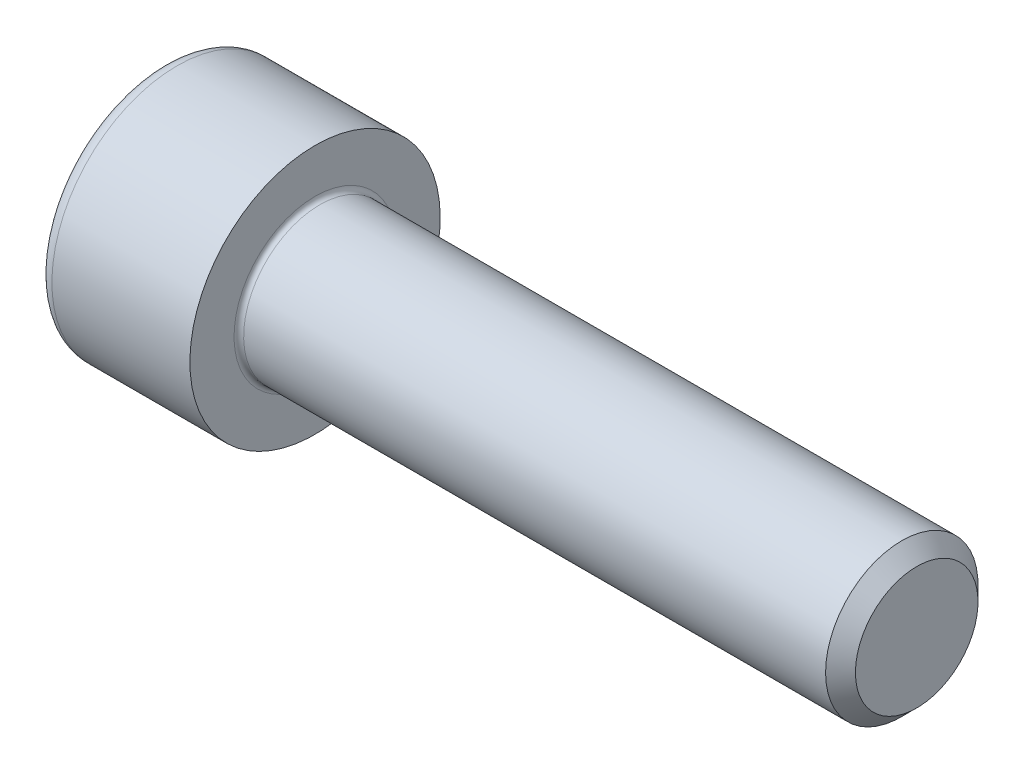
ISO-10303-21;
HEADER;
FILE_DESCRIPTION(('STEP AP214'),'2;1');
FILE_NAME('part.step','',(''),(''),'','','');
FILE_SCHEMA(('AUTOMOTIVE_DESIGN { 1 0 10303 214 1 1 1 1 }'));
ENDSEC;
DATA;
#1=APPLICATION_CONTEXT('core data for automotive mechanical design processes');
#2=APPLICATION_PROTOCOL_DEFINITION('international standard','automotive_design',2000,#1);
#3=PRODUCT_CONTEXT('',#1,'mechanical');
#4=PRODUCT('Part','Part','',(#3));
#5=PRODUCT_RELATED_PRODUCT_CATEGORY('part','',(#4));
#6=PRODUCT_DEFINITION_FORMATION('','',#4);
#7=PRODUCT_DEFINITION_CONTEXT('part definition',#1,'design');
#8=PRODUCT_DEFINITION('design','',#6,#7);
#9=PRODUCT_DEFINITION_SHAPE('','',#8);
#10=(LENGTH_UNIT() NAMED_UNIT(*) SI_UNIT(.MILLI.,.METRE.));
#11=(NAMED_UNIT(*) PLANE_ANGLE_UNIT() SI_UNIT($,.RADIAN.));
#12=(NAMED_UNIT(*) SI_UNIT($,.STERADIAN.) SOLID_ANGLE_UNIT());
#13=UNCERTAINTY_MEASURE_WITH_UNIT(LENGTH_MEASURE(1.E-05),#10,'distance_accuracy_value','');
#14=(GEOMETRIC_REPRESENTATION_CONTEXT(3) GLOBAL_UNCERTAINTY_ASSIGNED_CONTEXT((#13)) GLOBAL_UNIT_ASSIGNED_CONTEXT((#10,
#11,#12)) REPRESENTATION_CONTEXT('',''));
#15=CARTESIAN_POINT('',(0.,0.,0.));
#16=DIRECTION('',(0.,0.,1.));
#17=DIRECTION('',(1.,0.,0.));
#18=AXIS2_PLACEMENT_3D('',#15,#16,#17);
#19=CARTESIAN_POINT('',(-2.54792480126298,0.,0.));
#20=DIRECTION('',(-1.,0.,0.));
#21=DIRECTION('',(0.,0.,1.));
#22=AXIS2_PLACEMENT_3D('',#19,#20,#21);
#23=CONICAL_SURFACE('',#22,2.30141886197543,1.04719754991776);
#24=CARTESIAN_POINT('',(-1.21919999804732,-1.13686837721616E-10,0.));
#25=VERTEX_POINT('',#24);
#26=VERTEX_LOOP('',#25);
#27=FACE_BOUND('',#26,.T.);
#28=CARTESIAN_POINT('',(-2.54000000142803,1.98120000032526,1.14384635290626));
#29=CARTESIAN_POINT('',(-2.51097100848054,1.98120000011682,1.04331611318357));
#30=CARTESIAN_POINT('',(-2.48457065859602,1.98120000003131,0.941918097876422));
#31=CARTESIAN_POINT('',(-2.4384896407386,1.98119999996862,0.73736642845936));
#32=CARTESIAN_POINT('',(-2.41882527270383,1.98119999999169,0.634209141045213));
#33=CARTESIAN_POINT('',(-2.38821626617254,1.9812000000081,0.429172942767851));
#34=CARTESIAN_POINT('',(-2.37706788401862,1.98120000000216,0.327325570515035));
#35=CARTESIAN_POINT('',(-2.36376153116973,1.98119999999784,0.123151850494912));
#36=CARTESIAN_POINT('',(-2.36159253902039,1.98119999999946,0.0208262443343671));
#37=CARTESIAN_POINT('',(-2.36611630830126,1.98120000000047,-0.170358173456619));
#38=CARTESIAN_POINT('',(-2.37169833443295,1.98120000000013,-0.259245673867026));
#39=CARTESIAN_POINT('',(-2.38938650344235,1.98119999999987,-0.436441601614261));
#40=CARTESIAN_POINT('',(-2.40149868265029,1.98119999999996,-0.524749416535121));
#41=CARTESIAN_POINT('',(-2.43177678635069,1.98120000000004,-0.702310384603506));
#42=CARTESIAN_POINT('',(-2.45007099786355,1.98120000000002,-0.791541076350807));
#43=CARTESIAN_POINT('',(-2.49159112384591,1.98119999999998,-0.968671968992441));
#44=CARTESIAN_POINT('',(-2.5148072890003,1.98119999999996,-1.05657443738776));
#45=CARTESIAN_POINT('',(-2.54000000163953,1.9812,-1.14384635290124));
#46=B_SPLINE_CURVE_WITH_KNOTS('',3,(#28,#29,#30,#31,#32,#33,#34,#35,#36,#37,#38,#39,#40,#41,#42,
#43,#44,#45),.UNSPECIFIED.,.F.,.F.,(4,2,2,2,2,2,2,2,4),(0.,0.314036061113456,0.628826755288795,
0.935827354837613,1.24245102476025,1.50938492945134,1.77656600610952,2.04967187875051,
2.32224175984928),.UNSPECIFIED.);
#47=CARTESIAN_POINT('',(-2.54000000162459,1.98119999979693,1.14384635320125));
#48=VERTEX_POINT('',#47);
#49=CARTESIAN_POINT('',(-2.54000000169229,1.9812,-1.143846353084));
#50=VERTEX_POINT('',#49);
#51=EDGE_CURVE('E19',#48,#50,#46,.T.);
#52=ORIENTED_EDGE('',*,*,#51,.T.);
#53=CARTESIAN_POINT('',(-2.54000000142803,1.98119999980562,-1.14384635380629));
#54=CARTESIAN_POINT('',(-2.51097100848054,1.89413825825301,-1.19411147348712));
#55=CARTESIAN_POINT('',(-2.48457065859602,1.80632500106095,-1.24481048106664));
#56=CARTESIAN_POINT('',(-2.4384896407386,1.62917805892791,-1.34708631572088));
#57=CARTESIAN_POINT('',(-2.41882527270383,1.5398412274533,-1.39866495944794));
#58=CARTESIAN_POINT('',(-2.38821626617254,1.36227467105793,-1.50118305860083));
#59=CARTESIAN_POINT('',(-2.37706788401862,1.27407225937533,-1.55210674472209));
#60=CARTESIAN_POINT('',(-2.36376153116974,1.09725263105057,-1.65419360472841));
#61=CARTESIAN_POINT('',(-2.36159253902039,1.00863605665871,-1.70535640781009));
#62=CARTESIAN_POINT('',(-2.36611630830126,0.843065494044483,-1.80094861670645));
#63=CARTESIAN_POINT('',(-2.37169833443295,0.76608666061,-1.84539236691136));
#64=CARTESIAN_POINT('',(-2.38938650344236,0.612630485733617,-1.93399033078476));
#65=CARTESIAN_POINT('',(-2.40149868265029,0.536153674659503,-1.97814423824526));
#66=CARTESIAN_POINT('',(-2.43177678635069,0.382381365591762,-2.06692472227952));
#67=CARTESIAN_POINT('',(-2.45007099786355,0.305105319741333,-2.11154006815315));
#68=CARTESIAN_POINT('',(-2.49159112384592,0.151705466918646,-2.20010551447394));
#69=CARTESIAN_POINT('',(-2.5148072890003,0.0755796962329284,-2.24405674867158));
#70=CARTESIAN_POINT('',(-2.54000000163953,3.61344997547962E-10,-2.28769270642835));
#71=B_SPLINE_CURVE_WITH_KNOTS('',3,(#53,#54,#55,#56,#57,#58,#59,#60,#61,#62,#63,#64,#65,#66,#67,
#68,#69,#70),.UNSPECIFIED.,.F.,.F.,(4,2,2,2,2,2,2,2,4),(0.,0.314036061113456,0.628826755288795,
0.935827354837614,1.24245102476025,1.50938492945134,1.77656600610951,2.04967187875051,
2.32224175984927),.UNSPECIFIED.);
#72=CARTESIAN_POINT('',(-2.5400000016246,0.,-2.28769270640249));
#73=VERTEX_POINT('',#72);
#74=EDGE_CURVE('E79',#50,#73,#71,.T.);
#75=ORIENTED_EDGE('',*,*,#74,.T.);
#76=CARTESIAN_POINT('',(-2.54000000142803,-5.19638780479106E-10,-2.28769270671254));
#77=CARTESIAN_POINT('',(-2.51097100848054,-0.0870617418638079,-2.23742758667069));
#78=CARTESIAN_POINT('',(-2.48457065859602,-0.174874998970364,-2.18672857894306));
#79=CARTESIAN_POINT('',(-2.4384896407386,-0.35202194104071,-2.08445274418024));
#80=CARTESIAN_POINT('',(-2.41882527270384,-0.441358772538393,-2.03287410049315));
#81=CARTESIAN_POINT('',(-2.38821626617254,-0.618925328950177,-1.93035600136868));
#82=CARTESIAN_POINT('',(-2.37706788401862,-0.707127740626835,-1.87943231523712));
#83=CARTESIAN_POINT('',(-2.36376153116974,-0.883947368947275,-1.77734545522332));
#84=CARTESIAN_POINT('',(-2.36159253902039,-0.972563943340757,-1.72618265214445));
#85=CARTESIAN_POINT('',(-2.36611630830126,-1.13813450595599,-1.63059044324983));
#86=CARTESIAN_POINT('',(-2.37169833443295,-1.21511333939013,-1.58614669304433));
#87=CARTESIAN_POINT('',(-2.38938650344236,-1.36856951426626,-1.4975487291705));
#88=CARTESIAN_POINT('',(-2.40149868265029,-1.44504632534046,-1.45339482171014));
#89=CARTESIAN_POINT('',(-2.4317767863507,-1.59881863440828,-1.36461433767602));
#90=CARTESIAN_POINT('',(-2.45007099786355,-1.67609468025869,-1.31999899180235));
#91=CARTESIAN_POINT('',(-2.49159112384592,-1.82949453308134,-1.2314335454815));
#92=CARTESIAN_POINT('',(-2.5148072890003,-1.90562030376703,-1.18748231128383));
#93=CARTESIAN_POINT('',(-2.54000000163953,-1.98119999963865,-1.14384635352712));
#94=B_SPLINE_CURVE_WITH_KNOTS('',3,(#76,#77,#78,#79,#80,#81,#82,#83,#84,#85,#86,#87,#88,#89,#90,
#91,#92,#93),.UNSPECIFIED.,.F.,.F.,(4,2,2,2,2,2,2,2,4),(0.,0.314036061113457,0.628826755288796,
0.935827354837616,1.24245102476025,1.50938492945134,1.77656600610951,2.0496718787505,
2.32224175984926),.UNSPECIFIED.);
#95=CARTESIAN_POINT('',(-2.5400000016246,-1.98119999979693,-1.14384635320125));
#96=VERTEX_POINT('',#95);
#97=EDGE_CURVE('E104',#73,#96,#94,.T.);
#98=ORIENTED_EDGE('',*,*,#97,.T.);
#99=CARTESIAN_POINT('',(-2.54000000142803,-1.98120000032526,-1.14384635290626));
#100=CARTESIAN_POINT('',(-2.51097100848054,-1.98120000011682,-1.04331611318357));
#101=CARTESIAN_POINT('',(-2.48457065859602,-1.98120000003131,-0.941918097876424));
#102=CARTESIAN_POINT('',(-2.4384896407386,-1.98119999996862,-0.737366428459362));
#103=CARTESIAN_POINT('',(-2.41882527270383,-1.98119999999169,-0.634209141045214));
#104=CARTESIAN_POINT('',(-2.38821626617254,-1.9812000000081,-0.429172942767853));
#105=CARTESIAN_POINT('',(-2.37706788401862,-1.98120000000216,-0.327325570515037));
#106=CARTESIAN_POINT('',(-2.36376153116973,-1.98119999999784,-0.123151850494914));
#107=CARTESIAN_POINT('',(-2.36159253902039,-1.98119999999946,-0.020826244334369));
#108=CARTESIAN_POINT('',(-2.36611630830126,-1.98120000000047,0.170358173456617));
#109=CARTESIAN_POINT('',(-2.37169833443295,-1.98120000000013,0.259245673867024));
#110=CARTESIAN_POINT('',(-2.38938650344235,-1.98119999999987,0.436441601614259));
#111=CARTESIAN_POINT('',(-2.40149868265029,-1.98119999999996,0.52474941653512));
#112=CARTESIAN_POINT('',(-2.43177678635069,-1.98120000000004,0.702310384603505));
#113=CARTESIAN_POINT('',(-2.45007099786355,-1.98120000000002,0.791541076350806));
#114=CARTESIAN_POINT('',(-2.49159112384591,-1.98119999999998,0.96867196899244));
#115=CARTESIAN_POINT('',(-2.5148072890003,-1.98119999999996,1.05657443738776));
#116=CARTESIAN_POINT('',(-2.54000000163953,-1.9812,1.14384635290124));
#117=B_SPLINE_CURVE_WITH_KNOTS('',3,(#99,#100,#101,#102,#103,#104,#105,#106,#107,#108,#109,#110,
#111,#112,#113,#114,#115,#116),.UNSPECIFIED.,.F.,.F.,(4,2,2,2,2,2,2,2,4),(0.,0.314036061113456,
0.628826755288795,0.935827354837614,1.24245102476025,1.50938492945134,1.77656600610952,
2.04967187875052,2.32224175984928),.UNSPECIFIED.);
#118=CARTESIAN_POINT('',(-2.54000000162459,-1.98119999979693,1.14384635320125));
#119=VERTEX_POINT('',#118);
#120=EDGE_CURVE('E128',#96,#119,#117,.T.);
#121=ORIENTED_EDGE('',*,*,#120,.T.);
#122=CARTESIAN_POINT('',(-2.54000000142803,-1.98119999980562,1.14384635380629));
#123=CARTESIAN_POINT('',(-2.51097100848054,-1.89413825825301,1.19411147348712));
#124=CARTESIAN_POINT('',(-2.48457065859602,-1.80632500106095,1.24481048106664));
#125=CARTESIAN_POINT('',(-2.4384896407386,-1.62917805892791,1.34708631572088));
#126=CARTESIAN_POINT('',(-2.41882527270383,-1.5398412274533,1.39866495944794));
#127=CARTESIAN_POINT('',(-2.38821626617254,-1.36227467105793,1.50118305860083));
#128=CARTESIAN_POINT('',(-2.37706788401862,-1.27407225937533,1.55210674472209));
#129=CARTESIAN_POINT('',(-2.36376153116974,-1.09725263105057,1.65419360472841));
#130=CARTESIAN_POINT('',(-2.36159253902039,-1.00863605665871,1.70535640781009));
#131=CARTESIAN_POINT('',(-2.36611630830126,-0.843065494044483,1.80094861670645));
#132=CARTESIAN_POINT('',(-2.37169833443295,-0.76608666061,1.84539236691136));
#133=CARTESIAN_POINT('',(-2.38938650344236,-0.612630485733617,1.93399033078476));
#134=CARTESIAN_POINT('',(-2.40149868265029,-0.536153674659503,1.97814423824526));
#135=CARTESIAN_POINT('',(-2.43177678635069,-0.382381365591762,2.06692472227952));
#136=CARTESIAN_POINT('',(-2.45007099786355,-0.305105319741333,2.11154006815315));
#137=CARTESIAN_POINT('',(-2.49159112384591,-0.151705466918646,2.20010551447394));
#138=CARTESIAN_POINT('',(-2.5148072890003,-0.0755796962329291,2.24405674867158));
#139=CARTESIAN_POINT('',(-2.54000000163953,-3.61345646756782E-10,2.28769270642835));
#140=B_SPLINE_CURVE_WITH_KNOTS('',3,(#122,#123,#124,#125,#126,#127,#128,#129,#130,#131,#132,
#133,#134,#135,#136,#137,#138,#139),.UNSPECIFIED.,.F.,.F.,(4,2,2,2,2,2,2,2,4),(0.,
0.314036061113456,0.628826755288795,0.935827354837614,1.24245102476025,1.50938492945134,
1.77656600610951,2.04967187875051,2.32224175984927),.UNSPECIFIED.);
#141=CARTESIAN_POINT('',(-2.5400000016246,0.,2.28769270640249));
#142=VERTEX_POINT('',#141);
#143=EDGE_CURVE('E136',#119,#142,#140,.T.);
#144=ORIENTED_EDGE('',*,*,#143,.T.);
#145=CARTESIAN_POINT('',(-2.54000000142803,5.19638028011952E-10,2.28769270671254));
#146=CARTESIAN_POINT('',(-2.51097100848054,0.0870617418638069,2.23742758667069));
#147=CARTESIAN_POINT('',(-2.48457065859602,0.174874998970363,2.18672857894306));
#148=CARTESIAN_POINT('',(-2.4384896407386,0.352021941040709,2.08445274418023));
#149=CARTESIAN_POINT('',(-2.41882527270384,0.441358772538392,2.03287410049314));
#150=CARTESIAN_POINT('',(-2.38821626617254,0.618925328950176,1.93035600136868));
#151=CARTESIAN_POINT('',(-2.37706788401862,0.707127740626834,1.87943231523712));
#152=CARTESIAN_POINT('',(-2.36376153116974,0.883947368947274,1.77734545522332));
#153=CARTESIAN_POINT('',(-2.36159253902039,0.972563943340755,1.72618265214445));
#154=CARTESIAN_POINT('',(-2.36611630830126,1.13813450595599,1.63059044324983));
#155=CARTESIAN_POINT('',(-2.37169833443295,1.21511333939013,1.58614669304433));
#156=CARTESIAN_POINT('',(-2.38938650344236,1.36856951426626,1.49754872917049));
#157=CARTESIAN_POINT('',(-2.40149868265029,1.44504632534046,1.45339482171014));
#158=CARTESIAN_POINT('',(-2.43177678635069,1.59881863440828,1.36461433767602));
#159=CARTESIAN_POINT('',(-2.45007099786355,1.67609468025869,1.31999899180235));
#160=CARTESIAN_POINT('',(-2.49159112384592,1.82949453308134,1.2314335454815));
#161=CARTESIAN_POINT('',(-2.5148072890003,1.90562030376703,1.18748231128382));
#162=CARTESIAN_POINT('',(-2.54000000163953,1.98119999963865,1.14384635352712));
#163=B_SPLINE_CURVE_WITH_KNOTS('',3,(#145,#146,#147,#148,#149,#150,#151,#152,#153,#154,#155,
#156,#157,#158,#159,#160,#161,#162),.UNSPECIFIED.,.F.,.F.,(4,2,2,2,2,2,2,2,4),(0.,
0.314036061113457,0.628826755288796,0.935827354837616,1.24245102476025,1.50938492945134,
1.77656600610951,2.04967187875051,2.32224175984927),.UNSPECIFIED.);
#164=EDGE_CURVE('E81',#142,#48,#163,.T.);
#165=ORIENTED_EDGE('',*,*,#164,.T.);
#166=EDGE_LOOP('',(#52,#75,#98,#121,#144,#165));
#167=FACE_BOUND('',#166,.T.);
#168=ADVANCED_FACE('F15',(#27,#167),#23,.F.);
#169=CARTESIAN_POINT('',(-4.826,1.9812,1.14384635331849));
#170=DIRECTION('',(0.,1.,0.));
#171=DIRECTION('',(0.,0.,1.));
#172=AXIS2_PLACEMENT_3D('',#169,#170,#171);
#173=PLANE('',#172);
#174=DIRECTION('',(1.,0.,0.));
#175=VECTOR('',#174,1.);
#176=CARTESIAN_POINT('',(-4.826,1.9812,1.14384635331849));
#177=LINE('',#176,#175);
#178=CARTESIAN_POINT('',(-4.826,1.9812,1.14384635331849));
#179=VERTEX_POINT('',#178);
#180=EDGE_CURVE('E83',#48,#179,#177,.F.);
#181=ORIENTED_EDGE('',*,*,#180,.T.);
#182=DIRECTION('',(0.,0.,1.));
#183=VECTOR('',#182,1.);
#184=CARTESIAN_POINT('',(-4.826,1.9812,0.));
#185=LINE('',#184,#183);
#186=CARTESIAN_POINT('',(-4.826,1.9812,-1.14384635331849));
#187=VERTEX_POINT('',#186);
#188=EDGE_CURVE('E88',#187,#179,#185,.T.);
#189=ORIENTED_EDGE('',*,*,#188,.F.);
#190=DIRECTION('',(1.,0.,0.));
#191=VECTOR('',#190,1.);
#192=CARTESIAN_POINT('',(-4.826,1.9812,-1.14384635331849));
#193=LINE('',#192,#191);
#194=EDGE_CURVE('E86',#187,#50,#193,.T.);
#195=ORIENTED_EDGE('',*,*,#194,.T.);
#196=ORIENTED_EDGE('',*,*,#51,.F.);
#197=EDGE_LOOP('',(#181,#189,#195,#196));
#198=FACE_BOUND('',#197,.T.);
#199=ADVANCED_FACE('F75',(#198),#173,.F.);
#200=CARTESIAN_POINT('',(-4.826,0.,2.28769270663698));
#201=DIRECTION('',(0.,0.500000000000001,0.866025403784438));
#202=DIRECTION('',(0.,-0.866025403784438,0.500000000000001));
#203=AXIS2_PLACEMENT_3D('',#200,#201,#202);
#204=PLANE('',#203);
#205=DIRECTION('',(1.,0.,0.));
#206=VECTOR('',#205,1.);
#207=CARTESIAN_POINT('',(-4.826,0.,2.28769270663698));
#208=LINE('',#207,#206);
#209=CARTESIAN_POINT('',(-4.826,0.,2.28769270663698));
#210=VERTEX_POINT('',#209);
#211=EDGE_CURVE('E140',#142,#210,#208,.F.);
#212=ORIENTED_EDGE('',*,*,#211,.T.);
#213=DIRECTION('',(0.,-0.866025403784438,0.500000000000002));
#214=VECTOR('',#213,1.);
#215=CARTESIAN_POINT('',(-4.826,1.9812,1.14384635331849));
#216=LINE('',#215,#214);
#217=EDGE_CURVE('E94',#179,#210,#216,.T.);
#218=ORIENTED_EDGE('',*,*,#217,.F.);
#219=ORIENTED_EDGE('',*,*,#180,.F.);
#220=ORIENTED_EDGE('',*,*,#164,.F.);
#221=EDGE_LOOP('',(#212,#218,#219,#220));
#222=FACE_BOUND('',#221,.T.);
#223=ADVANCED_FACE('F144',(#222),#204,.F.);
#224=CARTESIAN_POINT('',(-4.826,-1.9812,1.14384635331849));
#225=DIRECTION('',(0.,-0.5,0.866025403784439));
#226=DIRECTION('',(0.,-0.866025403784439,-0.5));
#227=AXIS2_PLACEMENT_3D('',#224,#225,#226);
#228=PLANE('',#227);
#229=DIRECTION('',(1.,0.,0.));
#230=VECTOR('',#229,1.);
#231=CARTESIAN_POINT('',(-4.826,-1.9812,1.14384635331849));
#232=LINE('',#231,#230);
#233=CARTESIAN_POINT('',(-4.826,-1.9812,1.14384635331849));
#234=VERTEX_POINT('',#233);
#235=EDGE_CURVE('E135',#119,#234,#232,.F.);
#236=ORIENTED_EDGE('',*,*,#235,.T.);
#237=DIRECTION('',(0.,-0.866025403784438,-0.500000000000002));
#238=VECTOR('',#237,1.);
#239=CARTESIAN_POINT('',(-4.826,0.,2.28769270663698));
#240=LINE('',#239,#238);
#241=EDGE_CURVE('E245',#210,#234,#240,.T.);
#242=ORIENTED_EDGE('',*,*,#241,.F.);
#243=ORIENTED_EDGE('',*,*,#211,.F.);
#244=ORIENTED_EDGE('',*,*,#143,.F.);
#245=EDGE_LOOP('',(#236,#242,#243,#244));
#246=FACE_BOUND('',#245,.T.);
#247=ADVANCED_FACE('F124',(#246),#228,.F.);
#248=CARTESIAN_POINT('',(-4.826,-1.9812,-1.14384635331849));
#249=DIRECTION('',(0.,-1.,0.));
#250=DIRECTION('',(0.,0.,-1.));
#251=AXIS2_PLACEMENT_3D('',#248,#249,#250);
#252=PLANE('',#251);
#253=DIRECTION('',(1.,0.,0.));
#254=VECTOR('',#253,1.);
#255=CARTESIAN_POINT('',(-4.826,-1.9812,-1.1438463533185));
#256=LINE('',#255,#254);
#257=CARTESIAN_POINT('',(-4.826,-1.9812,-1.14384635331849));
#258=VERTEX_POINT('',#257);
#259=EDGE_CURVE('E134',#96,#258,#256,.F.);
#260=ORIENTED_EDGE('',*,*,#259,.T.);
#261=DIRECTION('',(0.,0.,1.));
#262=VECTOR('',#261,1.);
#263=CARTESIAN_POINT('',(-4.826,-1.9812,0.));
#264=LINE('',#263,#262);
#265=EDGE_CURVE('E242',#234,#258,#264,.F.);
#266=ORIENTED_EDGE('',*,*,#265,.F.);
#267=ORIENTED_EDGE('',*,*,#235,.F.);
#268=ORIENTED_EDGE('',*,*,#120,.F.);
#269=EDGE_LOOP('',(#260,#266,#267,#268));
#270=FACE_BOUND('',#269,.T.);
#271=ADVANCED_FACE('F120',(#270),#252,.F.);
#272=CARTESIAN_POINT('',(-4.826,0.,-2.28769270663698));
#273=DIRECTION('',(0.,-0.5,-0.866025403784439));
#274=DIRECTION('',(0.,0.866025403784439,-0.5));
#275=AXIS2_PLACEMENT_3D('',#272,#273,#274);
#276=PLANE('',#275);
#277=DIRECTION('',(1.,0.,0.));
#278=VECTOR('',#277,1.);
#279=CARTESIAN_POINT('',(-4.826,0.,-2.28769270663698));
#280=LINE('',#279,#278);
#281=CARTESIAN_POINT('',(-4.826,0.,-2.28769270663698));
#282=VERTEX_POINT('',#281);
#283=EDGE_CURVE('E37',#73,#282,#280,.F.);
#284=ORIENTED_EDGE('',*,*,#283,.T.);
#285=DIRECTION('',(0.,0.866025403784438,-0.500000000000002));
#286=VECTOR('',#285,1.);
#287=CARTESIAN_POINT('',(-4.826,-1.9812,-1.14384635331849));
#288=LINE('',#287,#286);
#289=EDGE_CURVE('E239',#258,#282,#288,.T.);
#290=ORIENTED_EDGE('',*,*,#289,.F.);
#291=ORIENTED_EDGE('',*,*,#259,.F.);
#292=ORIENTED_EDGE('',*,*,#97,.F.);
#293=EDGE_LOOP('',(#284,#290,#291,#292));
#294=FACE_BOUND('',#293,.T.);
#295=ADVANCED_FACE('F114',(#294),#276,.F.);
#296=CARTESIAN_POINT('',(-4.826,1.9812,-1.14384635331849));
#297=DIRECTION('',(0.,0.5,-0.866025403784439));
#298=DIRECTION('',(0.,0.866025403784439,0.5));
#299=AXIS2_PLACEMENT_3D('',#296,#297,#298);
#300=PLANE('',#299);
#301=ORIENTED_EDGE('',*,*,#194,.F.);
#302=DIRECTION('',(0.,0.866025403784438,0.500000000000002));
#303=VECTOR('',#302,1.);
#304=CARTESIAN_POINT('',(-4.826,0.,-2.28769270663698));
#305=LINE('',#304,#303);
#306=EDGE_CURVE('E237',#282,#187,#305,.T.);
#307=ORIENTED_EDGE('',*,*,#306,.F.);
#308=ORIENTED_EDGE('',*,*,#283,.F.);
#309=ORIENTED_EDGE('',*,*,#74,.F.);
#310=EDGE_LOOP('',(#301,#307,#308,#309));
#311=FACE_BOUND('',#310,.T.);
#312=ADVANCED_FACE('F92',(#311),#300,.F.);
#313=CARTESIAN_POINT('',(-4.826,3.12504635331849,0.));
#314=DIRECTION('',(-1.,0.,0.));
#315=DIRECTION('',(0.,0.,1.));
#316=AXIS2_PLACEMENT_3D('',#313,#314,#315);
#317=PLANE('',#316);
#318=ORIENTED_EDGE('',*,*,#289,.T.);
#319=ORIENTED_EDGE('',*,*,#306,.T.);
#320=ORIENTED_EDGE('',*,*,#188,.T.);
#321=ORIENTED_EDGE('',*,*,#217,.T.);
#322=ORIENTED_EDGE('',*,*,#241,.T.);
#323=ORIENTED_EDGE('',*,*,#265,.T.);
#324=EDGE_LOOP('',(#318,#319,#320,#321,#322,#323));
#325=FACE_BOUND('',#324,.T.);
#326=CARTESIAN_POINT('',(-4.826,0.,0.));
#327=DIRECTION('',(1.,0.,0.));
#328=DIRECTION('',(0.,1.,0.));
#329=AXIS2_PLACEMENT_3D('',#326,#327,#328);
#330=CIRCLE('',#329,3.5052);
#331=CARTESIAN_POINT('',(-4.826,3.5052,0.));
#332=VERTEX_POINT('',#331);
#333=EDGE_CURVE('E214',#332,#332,#330,.T.);
#334=ORIENTED_EDGE('',*,*,#333,.F.);
#335=EDGE_LOOP('',(#334));
#336=FACE_BOUND('',#335,.T.);
#337=ADVANCED_FACE('F113',(#325,#336),#317,.T.);
#338=CARTESIAN_POINT('',(-4.3688,0.,0.));
#339=DIRECTION('',(1.,0.,0.));
#340=DIRECTION('',(0.,0.,-1.));
#341=AXIS2_PLACEMENT_3D('',#338,#339,#340);
#342=TOROIDAL_SURFACE('',#341,3.5052,0.4572);
#343=CARTESIAN_POINT('',(-4.3688,0.,0.));
#344=DIRECTION('',(1.,0.,0.));
#345=DIRECTION('',(0.,1.,0.));
#346=AXIS2_PLACEMENT_3D('',#343,#344,#345);
#347=CIRCLE('',#346,3.9624);
#348=CARTESIAN_POINT('',(-4.3688,3.9624,0.));
#349=VERTEX_POINT('',#348);
#350=EDGE_CURVE('E254',#349,#349,#347,.T.);
#351=ORIENTED_EDGE('',*,*,#350,.F.);
#352=EDGE_LOOP('',(#351));
#353=FACE_BOUND('',#352,.T.);
#354=ORIENTED_EDGE('',*,*,#333,.T.);
#355=EDGE_LOOP('',(#354));
#356=FACE_BOUND('',#355,.T.);
#357=ADVANCED_FACE('F198',(#353,#356),#342,.T.);
#358=CARTESIAN_POINT('',(-2.413,0.,0.));
#359=DIRECTION('',(1.,0.,0.));
#360=DIRECTION('',(0.,1.,0.));
#361=AXIS2_PLACEMENT_3D('',#358,#359,#360);
#362=CYLINDRICAL_SURFACE('',#361,3.9624);
#363=ORIENTED_EDGE('',*,*,#350,.T.);
#364=EDGE_LOOP('',(#363));
#365=FACE_BOUND('',#364,.T.);
#366=CARTESIAN_POINT('',(0.,0.,0.));
#367=DIRECTION('',(1.,0.,0.));
#368=DIRECTION('',(0.,1.,0.));
#369=AXIS2_PLACEMENT_3D('',#366,#367,#368);
#370=CIRCLE('',#369,3.9624);
#371=CARTESIAN_POINT('',(0.,3.9624,0.));
#372=VERTEX_POINT('',#371);
#373=EDGE_CURVE('E102',#372,#372,#370,.T.);
#374=ORIENTED_EDGE('',*,*,#373,.F.);
#375=EDGE_LOOP('',(#374));
#376=FACE_BOUND('',#375,.T.);
#377=ADVANCED_FACE('F195',(#365,#376),#362,.T.);
#378=CARTESIAN_POINT('',(19.05,1.2065,0.));
#379=DIRECTION('',(1.,0.,0.));
#380=DIRECTION('',(0.,0.,-1.));
#381=AXIS2_PLACEMENT_3D('',#378,#379,#380);
#382=PLANE('',#381);
#383=CARTESIAN_POINT('',(19.0500000002203,0.,0.));
#384=DIRECTION('',(-1.,0.,0.));
#385=DIRECTION('',(0.,0.,1.));
#386=AXIS2_PLACEMENT_3D('',#383,#384,#385);
#387=CIRCLE('',#386,1.94056000026421);
#388=CARTESIAN_POINT('',(19.0500000002203,0.,1.94056000026421));
#389=VERTEX_POINT('',#388);
#390=EDGE_CURVE('E249',#389,#389,#387,.T.);
#391=ORIENTED_EDGE('',*,*,#390,.F.);
#392=EDGE_LOOP('',(#391));
#393=FACE_BOUND('',#392,.T.);
#394=ADVANCED_FACE('F192',(#393),#382,.T.);
#395=CARTESIAN_POINT('',(0.,3.1877,0.));
#396=DIRECTION('',(1.,0.,0.));
#397=DIRECTION('',(0.,0.,-1.));
#398=AXIS2_PLACEMENT_3D('',#395,#396,#397);
#399=PLANE('',#398);
#400=CARTESIAN_POINT('',(0.,0.,0.));
#401=DIRECTION('',(1.,0.,0.));
#402=DIRECTION('',(0.,1.,0.));
#403=AXIS2_PLACEMENT_3D('',#400,#401,#402);
#404=CIRCLE('',#403,2.5654);
#405=CARTESIAN_POINT('',(0.,2.5654,0.));
#406=VERTEX_POINT('',#405);
#407=EDGE_CURVE('E179',#406,#406,#404,.F.);
#408=ORIENTED_EDGE('',*,*,#407,.T.);
#409=EDGE_LOOP('',(#408));
#410=FACE_BOUND('',#409,.T.);
#411=ORIENTED_EDGE('',*,*,#373,.T.);
#412=EDGE_LOOP('',(#411));
#413=FACE_BOUND('',#412,.T.);
#414=ADVANCED_FACE('F183',(#410,#413),#399,.T.);
#415=CARTESIAN_POINT('',(18.5775599999261,0.,0.));
#416=DIRECTION('',(-1.,0.,0.));
#417=DIRECTION('',(0.,0.,1.));
#418=AXIS2_PLACEMENT_3D('',#415,#416,#417);
#419=CONICAL_SURFACE('',#418,2.41299999970579,0.785398162495057);
#420=ORIENTED_EDGE('',*,*,#390,.T.);
#421=EDGE_LOOP('',(#420));
#422=FACE_BOUND('',#421,.T.);
#423=CARTESIAN_POINT('',(18.57756,0.,0.));
#424=DIRECTION('',(1.,0.,0.));
#425=DIRECTION('',(0.,1.,0.));
#426=AXIS2_PLACEMENT_3D('',#423,#424,#425);
#427=CIRCLE('',#426,2.413);
#428=CARTESIAN_POINT('',(18.57756,2.413,0.));
#429=VERTEX_POINT('',#428);
#430=EDGE_CURVE('E28',#429,#429,#427,.F.);
#431=ORIENTED_EDGE('',*,*,#430,.F.);
#432=EDGE_LOOP('',(#431));
#433=FACE_BOUND('',#432,.T.);
#434=ADVANCED_FACE('F161',(#422,#433),#419,.T.);
#435=CARTESIAN_POINT('',(0.1524,0.,0.));
#436=DIRECTION('',(1.,0.,0.));
#437=DIRECTION('',(0.,0.,-1.));
#438=AXIS2_PLACEMENT_3D('',#435,#436,#437);
#439=TOROIDAL_SURFACE('',#438,2.5654,0.1524);
#440=CARTESIAN_POINT('',(0.1524,0.,0.));
#441=DIRECTION('',(1.,0.,0.));
#442=DIRECTION('',(0.,1.,0.));
#443=AXIS2_PLACEMENT_3D('',#440,#441,#442);
#444=CIRCLE('',#443,2.413);
#445=CARTESIAN_POINT('',(0.1524,2.413,0.));
#446=VERTEX_POINT('',#445);
#447=EDGE_CURVE('E10',#446,#446,#444,.T.);
#448=ORIENTED_EDGE('',*,*,#447,.F.);
#449=EDGE_LOOP('',(#448));
#450=FACE_BOUND('',#449,.T.);
#451=ORIENTED_EDGE('',*,*,#407,.F.);
#452=EDGE_LOOP('',(#451));
#453=FACE_BOUND('',#452,.T.);
#454=ADVANCED_FACE('F155',(#450,#453),#439,.F.);
#455=CARTESIAN_POINT('',(10.1204759998,0.,0.));
#456=DIRECTION('',(1.,0.,0.));
#457=DIRECTION('',(0.,1.,0.));
#458=AXIS2_PLACEMENT_3D('',#455,#456,#457);
#459=CYLINDRICAL_SURFACE('',#458,2.413);
#460=ORIENTED_EDGE('',*,*,#447,.T.);
#461=EDGE_LOOP('',(#460));
#462=FACE_BOUND('',#461,.T.);
#463=ORIENTED_EDGE('',*,*,#430,.T.);
#464=EDGE_LOOP('',(#463));
#465=FACE_BOUND('',#464,.T.);
#466=ADVANCED_FACE('F153',(#462,#465),#459,.T.);
#467=CLOSED_SHELL('',(#168,#199,#223,#247,#271,#295,#312,#337,#357,#377,#394,#414,#434,#454,#466));
#468=MANIFOLD_SOLID_BREP('B1',#467);
#469=ADVANCED_BREP_SHAPE_REPRESENTATION('',(#18,#468),#14);
#470=SHAPE_DEFINITION_REPRESENTATION(#9,#469);
ENDSEC;
END-ISO-10303-21;
